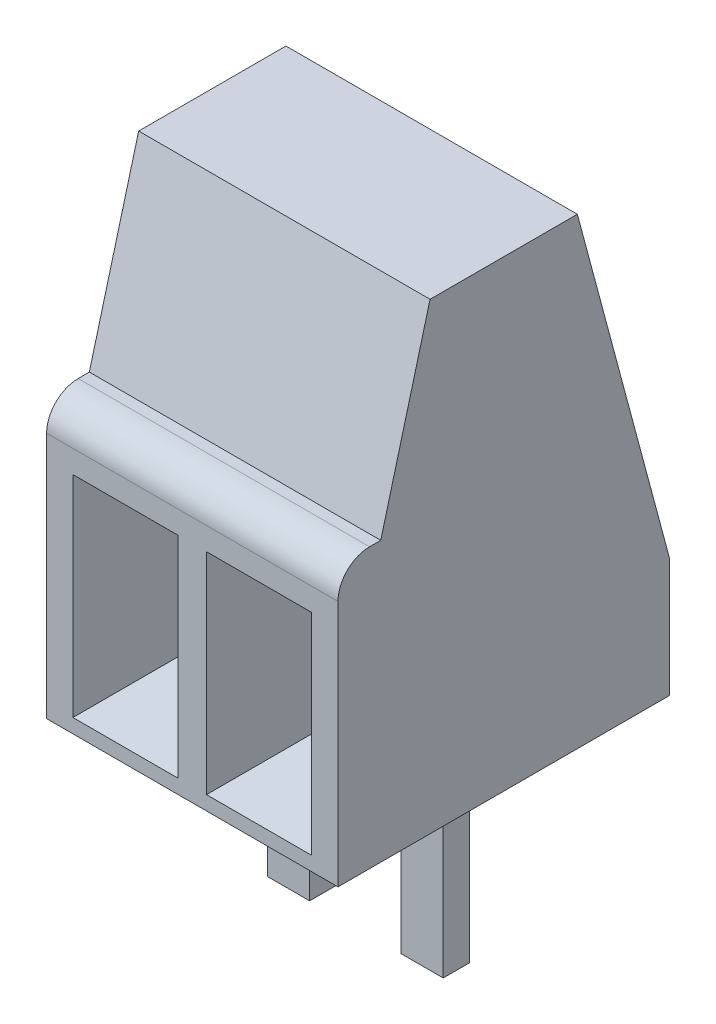
ISO-10303-21;
HEADER;
FILE_DESCRIPTION(('STEP AP214'),'2;1');
FILE_NAME('part.step','',(''),(''),'','','');
FILE_SCHEMA(('AUTOMOTIVE_DESIGN { 1 0 10303 214 1 1 1 1 }'));
ENDSEC;
DATA;
#1=APPLICATION_CONTEXT('core data for automotive mechanical design processes');
#2=APPLICATION_PROTOCOL_DEFINITION('international standard','automotive_design',2000,#1);
#3=PRODUCT_CONTEXT('',#1,'mechanical');
#4=PRODUCT('Part','Part','',(#3));
#5=PRODUCT_RELATED_PRODUCT_CATEGORY('part','',(#4));
#6=PRODUCT_DEFINITION_FORMATION('','',#4);
#7=PRODUCT_DEFINITION_CONTEXT('part definition',#1,'design');
#8=PRODUCT_DEFINITION('design','',#6,#7);
#9=PRODUCT_DEFINITION_SHAPE('','',#8);
#10=(LENGTH_UNIT() NAMED_UNIT(*) SI_UNIT(.MILLI.,.METRE.));
#11=(NAMED_UNIT(*) PLANE_ANGLE_UNIT() SI_UNIT($,.RADIAN.));
#12=(NAMED_UNIT(*) SI_UNIT($,.STERADIAN.) SOLID_ANGLE_UNIT());
#13=UNCERTAINTY_MEASURE_WITH_UNIT(LENGTH_MEASURE(1.E-05),#10,'distance_accuracy_value','');
#14=(GEOMETRIC_REPRESENTATION_CONTEXT(3) GLOBAL_UNCERTAINTY_ASSIGNED_CONTEXT((#13)) GLOBAL_UNIT_ASSIGNED_CONTEXT((#10,
#11,#12)) REPRESENTATION_CONTEXT('',''));
#15=CARTESIAN_POINT('',(0.,0.,0.));
#16=DIRECTION('',(0.,0.,1.));
#17=DIRECTION('',(1.,0.,0.));
#18=AXIS2_PLACEMENT_3D('',#15,#16,#17);
#19=CARTESIAN_POINT('',(2.77,8.8,3.15));
#20=DIRECTION('',(-1.,0.,0.));
#21=DIRECTION('',(0.,0.,1.));
#22=AXIS2_PLACEMENT_3D('',#19,#20,#21);
#23=PLANE('',#22);
#24=DIRECTION('',(0.,0.,-1.));
#25=VECTOR('',#24,1.);
#26=CARTESIAN_POINT('',(2.77,8.8,3.15));
#27=LINE('',#26,#25);
#28=CARTESIAN_POINT('',(2.77,8.8,1.4));
#29=VERTEX_POINT('',#28);
#30=CARTESIAN_POINT('',(2.77,8.8,-1.4));
#31=VERTEX_POINT('',#30);
#32=EDGE_CURVE('E361',#29,#31,#27,.T.);
#33=ORIENTED_EDGE('',*,*,#32,.F.);
#34=DIRECTION('',(0.,0.965925826289069,-0.258819045102518));
#35=VECTOR('',#34,1.);
#36=CARTESIAN_POINT('',(2.77,0.939488223348452,3.50621778264909));
#37=LINE('',#36,#35);
#38=CARTESIAN_POINT('',(2.77,5.3,2.33782217350892));
#39=VERTEX_POINT('',#38);
#40=EDGE_CURVE('E276',#39,#29,#37,.T.);
#41=ORIENTED_EDGE('',*,*,#40,.F.);
#42=DIRECTION('',(0.,0.,-1.));
#43=VECTOR('',#42,1.);
#44=CARTESIAN_POINT('',(2.77,5.3,0.));
#45=LINE('',#44,#43);
#46=CARTESIAN_POINT('',(2.77,5.3,2.55));
#47=VERTEX_POINT('',#46);
#48=EDGE_CURVE('E273',#47,#39,#45,.T.);
#49=ORIENTED_EDGE('',*,*,#48,.F.);
#50=CARTESIAN_POINT('',(2.77,4.7,2.55));
#51=DIRECTION('',(1.,0.,0.));
#52=DIRECTION('',(0.,0.,-1.));
#53=AXIS2_PLACEMENT_3D('',#50,#51,#52);
#54=CIRCLE('',#53,0.599999999999999);
#55=CARTESIAN_POINT('',(2.77,4.7,3.15));
#56=VERTEX_POINT('',#55);
#57=EDGE_CURVE('E270',#56,#47,#54,.F.);
#58=ORIENTED_EDGE('',*,*,#57,.F.);
#59=DIRECTION('',(0.,-1.,0.));
#60=VECTOR('',#59,1.);
#61=CARTESIAN_POINT('',(2.77,8.8,3.15));
#62=LINE('',#61,#60);
#63=CARTESIAN_POINT('',(2.77,0.,3.15));
#64=VERTEX_POINT('',#63);
#65=EDGE_CURVE('E368',#56,#64,#62,.T.);
#66=ORIENTED_EDGE('',*,*,#65,.T.);
#67=DIRECTION('',(0.,0.,-1.));
#68=VECTOR('',#67,1.);
#69=CARTESIAN_POINT('',(2.77,0.,3.15));
#70=LINE('',#69,#68);
#71=CARTESIAN_POINT('',(2.77,0.,-3.15));
#72=VERTEX_POINT('',#71);
#73=EDGE_CURVE('E352',#64,#72,#70,.T.);
#74=ORIENTED_EDGE('',*,*,#73,.T.);
#75=DIRECTION('',(0.,-1.,0.));
#76=VECTOR('',#75,1.);
#77=CARTESIAN_POINT('',(2.77,8.8,-3.15));
#78=LINE('',#77,#76);
#79=CARTESIAN_POINT('',(2.77,2.26891108675449,-3.15));
#80=VERTEX_POINT('',#79);
#81=EDGE_CURVE('E11',#80,#72,#78,.T.);
#82=ORIENTED_EDGE('',*,*,#81,.F.);
#83=DIRECTION('',(0.,-0.965925826289068,-0.258819045102522));
#84=VECTOR('',#83,1.);
#85=CARTESIAN_POINT('',(2.77,0.939488223348475,-3.50621778264911));
#86=LINE('',#85,#84);
#87=EDGE_CURVE('E222',#31,#80,#86,.T.);
#88=ORIENTED_EDGE('',*,*,#87,.F.);
#89=EDGE_LOOP('',(#33,#41,#49,#58,#66,#74,#82,#88));
#90=FACE_BOUND('',#89,.T.);
#91=ADVANCED_FACE('F33',(#90),#23,.F.);
#92=CARTESIAN_POINT('',(-2.77,8.8,-3.15));
#93=DIRECTION('',(0.,0.,1.));
#94=DIRECTION('',(1.,0.,0.));
#95=AXIS2_PLACEMENT_3D('',#92,#93,#94);
#96=PLANE('',#95);
#97=DIRECTION('',(0.,-1.,0.));
#98=VECTOR('',#97,1.);
#99=CARTESIAN_POINT('',(-2.77,8.8,-3.15));
#100=LINE('',#99,#98);
#101=CARTESIAN_POINT('',(-2.77,2.26891108675449,-3.15));
#102=VERTEX_POINT('',#101);
#103=CARTESIAN_POINT('',(-2.77,0.,-3.15));
#104=VERTEX_POINT('',#103);
#105=EDGE_CURVE('E40',#102,#104,#100,.T.);
#106=ORIENTED_EDGE('',*,*,#105,.F.);
#107=DIRECTION('',(1.,0.,0.));
#108=VECTOR('',#107,1.);
#109=CARTESIAN_POINT('',(-2.771,2.26891108675449,-3.15));
#110=LINE('',#109,#108);
#111=EDGE_CURVE('E292',#102,#80,#110,.T.);
#112=ORIENTED_EDGE('',*,*,#111,.T.);
#113=ORIENTED_EDGE('',*,*,#81,.T.);
#114=DIRECTION('',(-1.,0.,0.));
#115=VECTOR('',#114,1.);
#116=CARTESIAN_POINT('',(-2.77,0.,-3.15));
#117=LINE('',#116,#115);
#118=EDGE_CURVE('E371',#72,#104,#117,.T.);
#119=ORIENTED_EDGE('',*,*,#118,.T.);
#120=EDGE_LOOP('',(#106,#112,#113,#119));
#121=FACE_BOUND('',#120,.T.);
#122=ADVANCED_FACE('F392',(#121),#96,.F.);
#123=CARTESIAN_POINT('',(-2.77,8.8,3.15));
#124=DIRECTION('',(1.,0.,0.));
#125=DIRECTION('',(0.,0.,-1.));
#126=AXIS2_PLACEMENT_3D('',#123,#124,#125);
#127=PLANE('',#126);
#128=DIRECTION('',(0.,0.,1.));
#129=VECTOR('',#128,1.);
#130=CARTESIAN_POINT('',(-2.77,5.3,0.));
#131=LINE('',#130,#129);
#132=CARTESIAN_POINT('',(-2.77,5.3,2.33782217350892));
#133=VERTEX_POINT('',#132);
#134=CARTESIAN_POINT('',(-2.77,5.3,2.55));
#135=VERTEX_POINT('',#134);
#136=EDGE_CURVE('E263',#133,#135,#131,.T.);
#137=ORIENTED_EDGE('',*,*,#136,.F.);
#138=DIRECTION('',(0.,-0.965925826289069,0.258819045102518));
#139=VECTOR('',#138,1.);
#140=CARTESIAN_POINT('',(-2.77,0.939488223348452,3.50621778264909));
#141=LINE('',#140,#139);
#142=CARTESIAN_POINT('',(-2.77,8.8,1.4));
#143=VERTEX_POINT('',#142);
#144=EDGE_CURVE('E266',#143,#133,#141,.T.);
#145=ORIENTED_EDGE('',*,*,#144,.F.);
#146=DIRECTION('',(0.,0.,1.));
#147=VECTOR('',#146,1.);
#148=CARTESIAN_POINT('',(-2.77,8.8,3.15));
#149=LINE('',#148,#147);
#150=CARTESIAN_POINT('',(-2.77,8.8,-1.4));
#151=VERTEX_POINT('',#150);
#152=EDGE_CURVE('E364',#151,#143,#149,.T.);
#153=ORIENTED_EDGE('',*,*,#152,.F.);
#154=DIRECTION('',(0.,0.965925826289068,0.258819045102522));
#155=VECTOR('',#154,1.);
#156=CARTESIAN_POINT('',(-2.77,0.939488223348475,-3.50621778264911));
#157=LINE('',#156,#155);
#158=EDGE_CURVE('E267',#102,#151,#157,.T.);
#159=ORIENTED_EDGE('',*,*,#158,.F.);
#160=ORIENTED_EDGE('',*,*,#105,.T.);
#161=DIRECTION('',(0.,0.,1.));
#162=VECTOR('',#161,1.);
#163=CARTESIAN_POINT('',(-2.77,0.,3.15));
#164=LINE('',#163,#162);
#165=CARTESIAN_POINT('',(-2.77,0.,3.15));
#166=VERTEX_POINT('',#165);
#167=EDGE_CURVE('E374',#104,#166,#164,.T.);
#168=ORIENTED_EDGE('',*,*,#167,.T.);
#169=DIRECTION('',(0.,-1.,0.));
#170=VECTOR('',#169,1.);
#171=CARTESIAN_POINT('',(-2.77,8.8,3.15));
#172=LINE('',#171,#170);
#173=CARTESIAN_POINT('',(-2.77,4.7,3.15));
#174=VERTEX_POINT('',#173);
#175=EDGE_CURVE('E380',#174,#166,#172,.T.);
#176=ORIENTED_EDGE('',*,*,#175,.F.);
#177=CARTESIAN_POINT('',(-2.77,4.7,2.55));
#178=DIRECTION('',(1.,0.,0.));
#179=DIRECTION('',(0.,0.,-1.));
#180=AXIS2_PLACEMENT_3D('',#177,#178,#179);
#181=CIRCLE('',#180,0.599999999999999);
#182=EDGE_CURVE('E282',#135,#174,#181,.T.);
#183=ORIENTED_EDGE('',*,*,#182,.F.);
#184=EDGE_LOOP('',(#137,#145,#153,#159,#160,#168,#176,#183));
#185=FACE_BOUND('',#184,.T.);
#186=ADVANCED_FACE('F385',(#185),#127,.F.);
#187=CARTESIAN_POINT('',(-2.77,8.8,3.15));
#188=DIRECTION('',(0.,0.,-1.));
#189=DIRECTION('',(-1.,0.,0.));
#190=AXIS2_PLACEMENT_3D('',#187,#188,#189);
#191=PLANE('',#190);
#192=DIRECTION('',(-1.,0.,0.));
#193=VECTOR('',#192,1.);
#194=CARTESIAN_POINT('',(-2.27,4.26891108675449,3.15));
#195=LINE('',#194,#193);
#196=CARTESIAN_POINT('',(-0.27,4.26891108675449,3.15));
#197=VERTEX_POINT('',#196);
#198=CARTESIAN_POINT('',(-2.27,4.26891108675449,3.15));
#199=VERTEX_POINT('',#198);
#200=EDGE_CURVE('E207',#197,#199,#195,.T.);
#201=ORIENTED_EDGE('',*,*,#200,.F.);
#202=DIRECTION('',(0.,1.,0.));
#203=VECTOR('',#202,1.);
#204=CARTESIAN_POINT('',(-0.27,0.268911086754488,3.15));
#205=LINE('',#204,#203);
#206=CARTESIAN_POINT('',(-0.27,0.268911086754488,3.15));
#207=VERTEX_POINT('',#206);
#208=EDGE_CURVE('E47',#207,#197,#205,.T.);
#209=ORIENTED_EDGE('',*,*,#208,.F.);
#210=DIRECTION('',(1.,0.,0.));
#211=VECTOR('',#210,1.);
#212=CARTESIAN_POINT('',(-2.27,0.268911086754488,3.15));
#213=LINE('',#212,#211);
#214=CARTESIAN_POINT('',(-2.27,0.268911086754488,3.15));
#215=VERTEX_POINT('',#214);
#216=EDGE_CURVE('E214',#215,#207,#213,.T.);
#217=ORIENTED_EDGE('',*,*,#216,.F.);
#218=DIRECTION('',(0.,-1.,0.));
#219=VECTOR('',#218,1.);
#220=CARTESIAN_POINT('',(-2.27,0.268911086754488,3.15));
#221=LINE('',#220,#219);
#222=EDGE_CURVE('E196',#199,#215,#221,.T.);
#223=ORIENTED_EDGE('',*,*,#222,.F.);
#224=EDGE_LOOP('',(#201,#209,#217,#223));
#225=FACE_BOUND('',#224,.T.);
#226=DIRECTION('',(1.,0.,0.));
#227=VECTOR('',#226,1.);
#228=CARTESIAN_POINT('',(2.27,0.268911086754488,3.15));
#229=LINE('',#228,#227);
#230=CARTESIAN_POINT('',(0.27,0.268911086754487,3.15));
#231=VERTEX_POINT('',#230);
#232=CARTESIAN_POINT('',(2.27,0.268911086754488,3.15));
#233=VERTEX_POINT('',#232);
#234=EDGE_CURVE('E234',#231,#233,#229,.T.);
#235=ORIENTED_EDGE('',*,*,#234,.F.);
#236=DIRECTION('',(0.,-1.,0.));
#237=VECTOR('',#236,1.);
#238=CARTESIAN_POINT('',(0.269999999999999,4.26891108675449,3.15));
#239=LINE('',#238,#237);
#240=CARTESIAN_POINT('',(0.269999999999999,4.26891108675449,3.15));
#241=VERTEX_POINT('',#240);
#242=EDGE_CURVE('E55',#241,#231,#239,.T.);
#243=ORIENTED_EDGE('',*,*,#242,.F.);
#244=DIRECTION('',(-1.,0.,0.));
#245=VECTOR('',#244,1.);
#246=CARTESIAN_POINT('',(2.27,4.26891108675449,3.15));
#247=LINE('',#246,#245);
#248=CARTESIAN_POINT('',(2.27,4.26891108675449,3.15));
#249=VERTEX_POINT('',#248);
#250=EDGE_CURVE('E240',#249,#241,#247,.T.);
#251=ORIENTED_EDGE('',*,*,#250,.F.);
#252=DIRECTION('',(0.,1.,0.));
#253=VECTOR('',#252,1.);
#254=CARTESIAN_POINT('',(2.27,4.26891108675449,3.15));
#255=LINE('',#254,#253);
#256=EDGE_CURVE('E237',#233,#249,#255,.T.);
#257=ORIENTED_EDGE('',*,*,#256,.F.);
#258=EDGE_LOOP('',(#235,#243,#251,#257));
#259=FACE_BOUND('',#258,.T.);
#260=ORIENTED_EDGE('',*,*,#65,.F.);
#261=DIRECTION('',(1.,0.,0.));
#262=VECTOR('',#261,1.);
#263=CARTESIAN_POINT('',(-2.771,4.7,3.15));
#264=LINE('',#263,#262);
#265=EDGE_CURVE('E278',#174,#56,#264,.T.);
#266=ORIENTED_EDGE('',*,*,#265,.F.);
#267=ORIENTED_EDGE('',*,*,#175,.T.);
#268=DIRECTION('',(1.,0.,0.));
#269=VECTOR('',#268,1.);
#270=CARTESIAN_POINT('',(-2.77,0.,3.15));
#271=LINE('',#270,#269);
#272=EDGE_CURVE('E365',#166,#64,#271,.T.);
#273=ORIENTED_EDGE('',*,*,#272,.T.);
#274=EDGE_LOOP('',(#260,#266,#267,#273));
#275=FACE_BOUND('',#274,.T.);
#276=ADVANCED_FACE('F211',(#225,#259,#275),#191,.F.);
#277=CARTESIAN_POINT('',(0.,8.8,0.));
#278=DIRECTION('',(0.,-1.,0.));
#279=DIRECTION('',(0.,0.,-1.));
#280=AXIS2_PLACEMENT_3D('',#277,#278,#279);
#281=PLANE('',#280);
#282=ORIENTED_EDGE('',*,*,#152,.T.);
#283=DIRECTION('',(1.,0.,0.));
#284=VECTOR('',#283,1.);
#285=CARTESIAN_POINT('',(-2.771,8.8,1.4));
#286=LINE('',#285,#284);
#287=EDGE_CURVE('E279',#143,#29,#286,.T.);
#288=ORIENTED_EDGE('',*,*,#287,.T.);
#289=ORIENTED_EDGE('',*,*,#32,.T.);
#290=DIRECTION('',(1.,0.,0.));
#291=VECTOR('',#290,1.);
#292=CARTESIAN_POINT('',(-2.771,8.8,-1.4));
#293=LINE('',#292,#291);
#294=EDGE_CURVE('E291',#151,#31,#293,.T.);
#295=ORIENTED_EDGE('',*,*,#294,.F.);
#296=EDGE_LOOP('',(#282,#288,#289,#295));
#297=FACE_BOUND('',#296,.T.);
#298=ADVANCED_FACE('F413',(#297),#281,.F.);
#299=CARTESIAN_POINT('',(0.,0.,0.));
#300=DIRECTION('',(0.,-1.,0.));
#301=DIRECTION('',(0.,0.,-1.));
#302=AXIS2_PLACEMENT_3D('',#299,#300,#301);
#303=PLANE('',#302);
#304=DIRECTION('',(0.,0.,1.));
#305=VECTOR('',#304,1.);
#306=CARTESIAN_POINT('',(-1.67,0.,0.050000000000001));
#307=LINE('',#306,#305);
#308=CARTESIAN_POINT('',(-1.67,0.,-0.449999999999999));
#309=VERTEX_POINT('',#308);
#310=CARTESIAN_POINT('',(-1.67,0.,0.050000000000001));
#311=VERTEX_POINT('',#310);
#312=EDGE_CURVE('E289',#309,#311,#307,.T.);
#313=ORIENTED_EDGE('',*,*,#312,.T.);
#314=DIRECTION('',(1.,0.,0.));
#315=VECTOR('',#314,1.);
#316=CARTESIAN_POINT('',(-0.87,0.,0.0500000000000008));
#317=LINE('',#316,#315);
#318=CARTESIAN_POINT('',(-0.87,0.,0.0500000000000008));
#319=VERTEX_POINT('',#318);
#320=EDGE_CURVE('E312',#311,#319,#317,.T.);
#321=ORIENTED_EDGE('',*,*,#320,.T.);
#322=DIRECTION('',(0.,0.,-1.));
#323=VECTOR('',#322,1.);
#324=CARTESIAN_POINT('',(-0.87,0.,0.0500000000000008));
#325=LINE('',#324,#323);
#326=CARTESIAN_POINT('',(-0.87,0.,-0.449999999999999));
#327=VERTEX_POINT('',#326);
#328=EDGE_CURVE('E314',#319,#327,#325,.T.);
#329=ORIENTED_EDGE('',*,*,#328,.T.);
#330=DIRECTION('',(-1.,0.,0.));
#331=VECTOR('',#330,1.);
#332=CARTESIAN_POINT('',(-0.87,0.,-0.449999999999999));
#333=LINE('',#332,#331);
#334=EDGE_CURVE('E301',#327,#309,#333,.T.);
#335=ORIENTED_EDGE('',*,*,#334,.T.);
#336=EDGE_LOOP('',(#313,#321,#329,#335));
#337=FACE_BOUND('',#336,.T.);
#338=DIRECTION('',(0.,0.,-1.));
#339=VECTOR('',#338,1.);
#340=CARTESIAN_POINT('',(1.67,0.,0.0500000000000007));
#341=LINE('',#340,#339);
#342=CARTESIAN_POINT('',(1.67,0.,0.0500000000000007));
#343=VERTEX_POINT('',#342);
#344=CARTESIAN_POINT('',(1.67,0.,-0.449999999999999));
#345=VERTEX_POINT('',#344);
#346=EDGE_CURVE('E320',#343,#345,#341,.T.);
#347=ORIENTED_EDGE('',*,*,#346,.T.);
#348=DIRECTION('',(-1.,0.,0.));
#349=VECTOR('',#348,1.);
#350=CARTESIAN_POINT('',(0.87,0.,-0.449999999999999));
#351=LINE('',#350,#349);
#352=CARTESIAN_POINT('',(0.87,0.,-0.449999999999999));
#353=VERTEX_POINT('',#352);
#354=EDGE_CURVE('E344',#345,#353,#351,.T.);
#355=ORIENTED_EDGE('',*,*,#354,.T.);
#356=DIRECTION('',(0.,0.,1.));
#357=VECTOR('',#356,1.);
#358=CARTESIAN_POINT('',(0.87,0.,0.0500000000000007));
#359=LINE('',#358,#357);
#360=CARTESIAN_POINT('',(0.87,0.,0.0500000000000007));
#361=VERTEX_POINT('',#360);
#362=EDGE_CURVE('E346',#353,#361,#359,.T.);
#363=ORIENTED_EDGE('',*,*,#362,.T.);
#364=DIRECTION('',(1.,0.,0.));
#365=VECTOR('',#364,1.);
#366=CARTESIAN_POINT('',(0.87,0.,0.0500000000000007));
#367=LINE('',#366,#365);
#368=EDGE_CURVE('E333',#361,#343,#367,.T.);
#369=ORIENTED_EDGE('',*,*,#368,.T.);
#370=EDGE_LOOP('',(#347,#355,#363,#369));
#371=FACE_BOUND('',#370,.T.);
#372=ORIENTED_EDGE('',*,*,#73,.F.);
#373=ORIENTED_EDGE('',*,*,#272,.F.);
#374=ORIENTED_EDGE('',*,*,#167,.F.);
#375=ORIENTED_EDGE('',*,*,#118,.F.);
#376=EDGE_LOOP('',(#372,#373,#374,#375));
#377=FACE_BOUND('',#376,.T.);
#378=ADVANCED_FACE('F396',(#337,#371,#377),#303,.T.);
#379=CARTESIAN_POINT('',(1.67,-3.6,0.0500000000000007));
#380=DIRECTION('',(1.,0.,0.));
#381=DIRECTION('',(0.,0.,-1.));
#382=AXIS2_PLACEMENT_3D('',#379,#380,#381);
#383=PLANE('',#382);
#384=ORIENTED_EDGE('',*,*,#346,.F.);
#385=DIRECTION('',(0.,1.,0.));
#386=VECTOR('',#385,1.);
#387=CARTESIAN_POINT('',(1.67,-3.6,0.0500000000000007));
#388=LINE('',#387,#386);
#389=CARTESIAN_POINT('',(1.67,-3.6,0.0500000000000007));
#390=VERTEX_POINT('',#389);
#391=EDGE_CURVE('E349',#390,#343,#388,.T.);
#392=ORIENTED_EDGE('',*,*,#391,.F.);
#393=DIRECTION('',(0.,0.,-1.));
#394=VECTOR('',#393,1.);
#395=CARTESIAN_POINT('',(1.67,-3.6,0.0500000000000007));
#396=LINE('',#395,#394);
#397=CARTESIAN_POINT('',(1.67,-3.6,-0.449999999999999));
#398=VERTEX_POINT('',#397);
#399=EDGE_CURVE('E329',#390,#398,#396,.T.);
#400=ORIENTED_EDGE('',*,*,#399,.T.);
#401=DIRECTION('',(0.,1.,0.));
#402=VECTOR('',#401,1.);
#403=CARTESIAN_POINT('',(1.67,-3.6,-0.449999999999999));
#404=LINE('',#403,#402);
#405=EDGE_CURVE('E342',#398,#345,#404,.T.);
#406=ORIENTED_EDGE('',*,*,#405,.T.);
#407=EDGE_LOOP('',(#384,#392,#400,#406));
#408=FACE_BOUND('',#407,.T.);
#409=ADVANCED_FACE('F432',(#408),#383,.T.);
#410=CARTESIAN_POINT('',(0.87,-3.6,0.0500000000000007));
#411=DIRECTION('',(0.,0.,1.));
#412=DIRECTION('',(1.,0.,0.));
#413=AXIS2_PLACEMENT_3D('',#410,#411,#412);
#414=PLANE('',#413);
#415=ORIENTED_EDGE('',*,*,#368,.F.);
#416=DIRECTION('',(0.,1.,0.));
#417=VECTOR('',#416,1.);
#418=CARTESIAN_POINT('',(0.87,-3.6,0.0500000000000007));
#419=LINE('',#418,#417);
#420=CARTESIAN_POINT('',(0.87,-3.6,0.0500000000000007));
#421=VERTEX_POINT('',#420);
#422=EDGE_CURVE('E353',#421,#361,#419,.T.);
#423=ORIENTED_EDGE('',*,*,#422,.F.);
#424=DIRECTION('',(1.,0.,0.));
#425=VECTOR('',#424,1.);
#426=CARTESIAN_POINT('',(0.87,-3.6,0.0500000000000007));
#427=LINE('',#426,#425);
#428=EDGE_CURVE('E339',#421,#390,#427,.T.);
#429=ORIENTED_EDGE('',*,*,#428,.T.);
#430=ORIENTED_EDGE('',*,*,#391,.T.);
#431=EDGE_LOOP('',(#415,#423,#429,#430));
#432=FACE_BOUND('',#431,.T.);
#433=ADVANCED_FACE('F438',(#432),#414,.T.);
#434=CARTESIAN_POINT('',(0.87,-3.6,0.0500000000000007));
#435=DIRECTION('',(-1.,0.,0.));
#436=DIRECTION('',(0.,0.,1.));
#437=AXIS2_PLACEMENT_3D('',#434,#435,#436);
#438=PLANE('',#437);
#439=ORIENTED_EDGE('',*,*,#362,.F.);
#440=DIRECTION('',(0.,1.,0.));
#441=VECTOR('',#440,1.);
#442=CARTESIAN_POINT('',(0.87,-3.6,-0.449999999999999));
#443=LINE('',#442,#441);
#444=CARTESIAN_POINT('',(0.87,-3.6,-0.449999999999999));
#445=VERTEX_POINT('',#444);
#446=EDGE_CURVE('E356',#445,#353,#443,.T.);
#447=ORIENTED_EDGE('',*,*,#446,.F.);
#448=DIRECTION('',(0.,0.,1.));
#449=VECTOR('',#448,1.);
#450=CARTESIAN_POINT('',(0.87,-3.6,0.0500000000000007));
#451=LINE('',#450,#449);
#452=EDGE_CURVE('E336',#445,#421,#451,.T.);
#453=ORIENTED_EDGE('',*,*,#452,.T.);
#454=ORIENTED_EDGE('',*,*,#422,.T.);
#455=EDGE_LOOP('',(#439,#447,#453,#454));
#456=FACE_BOUND('',#455,.T.);
#457=ADVANCED_FACE('F444',(#456),#438,.T.);
#458=CARTESIAN_POINT('',(0.87,-3.6,-0.449999999999999));
#459=DIRECTION('',(0.,0.,-1.));
#460=DIRECTION('',(-1.,0.,0.));
#461=AXIS2_PLACEMENT_3D('',#458,#459,#460);
#462=PLANE('',#461);
#463=ORIENTED_EDGE('',*,*,#354,.F.);
#464=ORIENTED_EDGE('',*,*,#405,.F.);
#465=DIRECTION('',(-1.,0.,0.));
#466=VECTOR('',#465,1.);
#467=CARTESIAN_POINT('',(0.87,-3.6,-0.449999999999999));
#468=LINE('',#467,#466);
#469=EDGE_CURVE('E332',#398,#445,#468,.T.);
#470=ORIENTED_EDGE('',*,*,#469,.T.);
#471=ORIENTED_EDGE('',*,*,#446,.T.);
#472=EDGE_LOOP('',(#463,#464,#470,#471));
#473=FACE_BOUND('',#472,.T.);
#474=ADVANCED_FACE('F440',(#473),#462,.T.);
#475=CARTESIAN_POINT('',(0.,-3.6,0.));
#476=DIRECTION('',(0.,-1.,0.));
#477=DIRECTION('',(0.,0.,-1.));
#478=AXIS2_PLACEMENT_3D('',#475,#476,#477);
#479=PLANE('',#478);
#480=ORIENTED_EDGE('',*,*,#399,.F.);
#481=ORIENTED_EDGE('',*,*,#428,.F.);
#482=ORIENTED_EDGE('',*,*,#452,.F.);
#483=ORIENTED_EDGE('',*,*,#469,.F.);
#484=EDGE_LOOP('',(#480,#481,#482,#483));
#485=FACE_BOUND('',#484,.T.);
#486=ADVANCED_FACE('F443',(#485),#479,.T.);
#487=CARTESIAN_POINT('',(-1.67,-3.6,0.050000000000001));
#488=DIRECTION('',(-1.,0.,0.));
#489=DIRECTION('',(0.,0.,1.));
#490=AXIS2_PLACEMENT_3D('',#487,#488,#489);
#491=PLANE('',#490);
#492=ORIENTED_EDGE('',*,*,#312,.F.);
#493=DIRECTION('',(0.,1.,0.));
#494=VECTOR('',#493,1.);
#495=CARTESIAN_POINT('',(-1.67,-3.6,-0.449999999999999));
#496=LINE('',#495,#494);
#497=CARTESIAN_POINT('',(-1.67,-3.6,-0.449999999999999));
#498=VERTEX_POINT('',#497);
#499=EDGE_CURVE('E317',#498,#309,#496,.T.);
#500=ORIENTED_EDGE('',*,*,#499,.F.);
#501=DIRECTION('',(0.,0.,1.));
#502=VECTOR('',#501,1.);
#503=CARTESIAN_POINT('',(-1.67,-3.6,0.050000000000001));
#504=LINE('',#503,#502);
#505=CARTESIAN_POINT('',(-1.67,-3.6,0.050000000000001));
#506=VERTEX_POINT('',#505);
#507=EDGE_CURVE('E297',#498,#506,#504,.T.);
#508=ORIENTED_EDGE('',*,*,#507,.T.);
#509=DIRECTION('',(0.,1.,0.));
#510=VECTOR('',#509,1.);
#511=CARTESIAN_POINT('',(-1.67,-3.6,0.050000000000001));
#512=LINE('',#511,#510);
#513=EDGE_CURVE('E310',#506,#311,#512,.T.);
#514=ORIENTED_EDGE('',*,*,#513,.T.);
#515=EDGE_LOOP('',(#492,#500,#508,#514));
#516=FACE_BOUND('',#515,.T.);
#517=ADVANCED_FACE('F454',(#516),#491,.T.);
#518=CARTESIAN_POINT('',(-0.87,-3.6,-0.449999999999999));
#519=DIRECTION('',(0.,0.,-1.));
#520=DIRECTION('',(-1.,0.,0.));
#521=AXIS2_PLACEMENT_3D('',#518,#519,#520);
#522=PLANE('',#521);
#523=ORIENTED_EDGE('',*,*,#334,.F.);
#524=DIRECTION('',(0.,1.,0.));
#525=VECTOR('',#524,1.);
#526=CARTESIAN_POINT('',(-0.87,-3.6,-0.449999999999999));
#527=LINE('',#526,#525);
#528=CARTESIAN_POINT('',(-0.87,-3.6,-0.449999999999999));
#529=VERTEX_POINT('',#528);
#530=EDGE_CURVE('E321',#529,#327,#527,.T.);
#531=ORIENTED_EDGE('',*,*,#530,.F.);
#532=DIRECTION('',(-1.,0.,0.));
#533=VECTOR('',#532,1.);
#534=CARTESIAN_POINT('',(-0.87,-3.6,-0.449999999999999));
#535=LINE('',#534,#533);
#536=EDGE_CURVE('E307',#529,#498,#535,.T.);
#537=ORIENTED_EDGE('',*,*,#536,.T.);
#538=ORIENTED_EDGE('',*,*,#499,.T.);
#539=EDGE_LOOP('',(#523,#531,#537,#538));
#540=FACE_BOUND('',#539,.T.);
#541=ADVANCED_FACE('F458',(#540),#522,.T.);
#542=CARTESIAN_POINT('',(-0.87,-3.6,0.0500000000000008));
#543=DIRECTION('',(1.,0.,0.));
#544=DIRECTION('',(0.,0.,-1.));
#545=AXIS2_PLACEMENT_3D('',#542,#543,#544);
#546=PLANE('',#545);
#547=ORIENTED_EDGE('',*,*,#328,.F.);
#548=DIRECTION('',(0.,1.,0.));
#549=VECTOR('',#548,1.);
#550=CARTESIAN_POINT('',(-0.87,-3.6,0.0500000000000008));
#551=LINE('',#550,#549);
#552=CARTESIAN_POINT('',(-0.87,-3.6,0.0500000000000008));
#553=VERTEX_POINT('',#552);
#554=EDGE_CURVE('E324',#553,#319,#551,.T.);
#555=ORIENTED_EDGE('',*,*,#554,.F.);
#556=DIRECTION('',(0.,0.,-1.));
#557=VECTOR('',#556,1.);
#558=CARTESIAN_POINT('',(-0.87,-3.6,0.0500000000000008));
#559=LINE('',#558,#557);
#560=EDGE_CURVE('E304',#553,#529,#559,.T.);
#561=ORIENTED_EDGE('',*,*,#560,.T.);
#562=ORIENTED_EDGE('',*,*,#530,.T.);
#563=EDGE_LOOP('',(#547,#555,#561,#562));
#564=FACE_BOUND('',#563,.T.);
#565=ADVANCED_FACE('F464',(#564),#546,.T.);
#566=CARTESIAN_POINT('',(-0.87,-3.6,0.0500000000000008));
#567=DIRECTION('',(0.,0.,1.));
#568=DIRECTION('',(1.,0.,0.));
#569=AXIS2_PLACEMENT_3D('',#566,#567,#568);
#570=PLANE('',#569);
#571=ORIENTED_EDGE('',*,*,#320,.F.);
#572=ORIENTED_EDGE('',*,*,#513,.F.);
#573=DIRECTION('',(1.,0.,0.));
#574=VECTOR('',#573,1.);
#575=CARTESIAN_POINT('',(-0.87,-3.6,0.0500000000000008));
#576=LINE('',#575,#574);
#577=EDGE_CURVE('E300',#506,#553,#576,.T.);
#578=ORIENTED_EDGE('',*,*,#577,.T.);
#579=ORIENTED_EDGE('',*,*,#554,.T.);
#580=EDGE_LOOP('',(#571,#572,#578,#579));
#581=FACE_BOUND('',#580,.T.);
#582=ADVANCED_FACE('F460',(#581),#570,.T.);
#583=CARTESIAN_POINT('',(0.,-3.6,0.));
#584=DIRECTION('',(0.,1.,0.));
#585=DIRECTION('',(0.,0.,1.));
#586=AXIS2_PLACEMENT_3D('',#583,#584,#585);
#587=PLANE('',#586);
#588=ORIENTED_EDGE('',*,*,#507,.F.);
#589=ORIENTED_EDGE('',*,*,#536,.F.);
#590=ORIENTED_EDGE('',*,*,#560,.F.);
#591=ORIENTED_EDGE('',*,*,#577,.F.);
#592=EDGE_LOOP('',(#588,#589,#590,#591));
#593=FACE_BOUND('',#592,.T.);
#594=ADVANCED_FACE('F463',(#593),#587,.F.);
#595=CARTESIAN_POINT('',(-2.771,0.939488223348475,-3.50621778264911));
#596=DIRECTION('',(0.,-0.258819045102522,0.965925826289068));
#597=DIRECTION('',(0.,-0.965925826289068,-0.258819045102522));
#598=AXIS2_PLACEMENT_3D('',#595,#596,#597);
#599=PLANE('',#598);
#600=ORIENTED_EDGE('',*,*,#158,.T.);
#601=ORIENTED_EDGE('',*,*,#294,.T.);
#602=ORIENTED_EDGE('',*,*,#87,.T.);
#603=ORIENTED_EDGE('',*,*,#111,.F.);
#604=EDGE_LOOP('',(#600,#601,#602,#603));
#605=FACE_BOUND('',#604,.T.);
#606=ADVANCED_FACE('F417',(#605),#599,.F.);
#607=CARTESIAN_POINT('',(-2.771,0.939488223348452,3.50621778264909));
#608=DIRECTION('',(0.,-0.258819045102518,-0.965925826289069));
#609=DIRECTION('',(0.,0.965925826289069,-0.258819045102518));
#610=AXIS2_PLACEMENT_3D('',#607,#608,#609);
#611=PLANE('',#610);
#612=ORIENTED_EDGE('',*,*,#144,.T.);
#613=DIRECTION('',(1.,0.,0.));
#614=VECTOR('',#613,1.);
#615=CARTESIAN_POINT('',(-2.771,5.3,2.33782217350892));
#616=LINE('',#615,#614);
#617=EDGE_CURVE('E283',#133,#39,#616,.T.);
#618=ORIENTED_EDGE('',*,*,#617,.T.);
#619=ORIENTED_EDGE('',*,*,#40,.T.);
#620=ORIENTED_EDGE('',*,*,#287,.F.);
#621=EDGE_LOOP('',(#612,#618,#619,#620));
#622=FACE_BOUND('',#621,.T.);
#623=ADVANCED_FACE('F410',(#622),#611,.F.);
#624=CARTESIAN_POINT('',(-2.771,5.3,0.));
#625=DIRECTION('',(0.,-1.,0.));
#626=DIRECTION('',(0.,0.,-1.));
#627=AXIS2_PLACEMENT_3D('',#624,#625,#626);
#628=PLANE('',#627);
#629=ORIENTED_EDGE('',*,*,#136,.T.);
#630=DIRECTION('',(1.,0.,0.));
#631=VECTOR('',#630,1.);
#632=CARTESIAN_POINT('',(-2.771,5.3,2.55));
#633=LINE('',#632,#631);
#634=EDGE_CURVE('E285',#135,#47,#633,.T.);
#635=ORIENTED_EDGE('',*,*,#634,.T.);
#636=ORIENTED_EDGE('',*,*,#48,.T.);
#637=ORIENTED_EDGE('',*,*,#617,.F.);
#638=EDGE_LOOP('',(#629,#635,#636,#637));
#639=FACE_BOUND('',#638,.T.);
#640=ADVANCED_FACE('F407',(#639),#628,.F.);
#641=CARTESIAN_POINT('',(-2.771,4.7,2.55));
#642=DIRECTION('',(1.,0.,0.));
#643=DIRECTION('',(0.,0.,-1.));
#644=AXIS2_PLACEMENT_3D('',#641,#642,#643);
#645=CYLINDRICAL_SURFACE('',#644,0.599999999999999);
#646=ORIENTED_EDGE('',*,*,#182,.T.);
#647=ORIENTED_EDGE('',*,*,#265,.T.);
#648=ORIENTED_EDGE('',*,*,#57,.T.);
#649=ORIENTED_EDGE('',*,*,#634,.F.);
#650=EDGE_LOOP('',(#646,#647,#648,#649));
#651=FACE_BOUND('',#650,.T.);
#652=ADVANCED_FACE('F403',(#651),#645,.T.);
#653=CARTESIAN_POINT('',(0.269999999999999,4.26891108675449,3.15));
#654=DIRECTION('',(-0.984807753012208,0.,-0.173648177666931));
#655=DIRECTION('',(-0.173648177666931,0.,0.984807753012208));
#656=AXIS2_PLACEMENT_3D('',#653,#654,#655);
#657=PLANE('',#656);
#658=ORIENTED_EDGE('',*,*,#242,.T.);
#659=DIRECTION('',(-0.171087869746036,-0.171087869746036,0.970287525247814));
#660=VECTOR('',#659,1.);
#661=CARTESIAN_POINT('',(0.387084236696946,0.385995323451434,2.48598229705679));
#662=LINE('',#661,#660);
#663=CARTESIAN_POINT('',(0.825429989231666,0.824341075986154,0.));
#664=VERTEX_POINT('',#663);
#665=EDGE_CURVE('E247',#664,#231,#662,.T.);
#666=ORIENTED_EDGE('',*,*,#665,.F.);
#667=DIRECTION('',(0.,-1.,0.));
#668=VECTOR('',#667,1.);
#669=CARTESIAN_POINT('',(0.825429989231665,4.26891108675449,0.));
#670=LINE('',#669,#668);
#671=CARTESIAN_POINT('',(0.825429989231665,3.71348109752282,0.));
#672=VERTEX_POINT('',#671);
#673=EDGE_CURVE('E243',#672,#664,#670,.T.);
#674=ORIENTED_EDGE('',*,*,#673,.F.);
#675=DIRECTION('',(-0.171087869746036,0.171087869746036,0.970287525247814));
#676=VECTOR('',#675,1.);
#677=CARTESIAN_POINT('',(0.328542118348473,4.21036896840601,2.8179911485284));
#678=LINE('',#677,#676);
#679=EDGE_CURVE('E244',#672,#241,#678,.T.);
#680=ORIENTED_EDGE('',*,*,#679,.T.);
#681=EDGE_LOOP('',(#658,#666,#674,#680));
#682=FACE_BOUND('',#681,.T.);
#683=ADVANCED_FACE('F479',(#682),#657,.F.);
#684=CARTESIAN_POINT('',(2.27,4.26891108675449,3.15));
#685=DIRECTION('',(0.,0.984807753012208,-0.173648177666931));
#686=DIRECTION('',(0.,0.173648177666931,0.984807753012208));
#687=AXIS2_PLACEMENT_3D('',#684,#685,#686);
#688=PLANE('',#687);
#689=ORIENTED_EDGE('',*,*,#250,.T.);
#690=ORIENTED_EDGE('',*,*,#679,.F.);
#691=DIRECTION('',(-1.,0.,0.));
#692=VECTOR('',#691,1.);
#693=CARTESIAN_POINT('',(2.27,3.71348109752282,0.));
#694=LINE('',#693,#692);
#695=CARTESIAN_POINT('',(1.71457001076833,3.71348109752282,0.));
#696=VERTEX_POINT('',#695);
#697=EDGE_CURVE('E250',#696,#672,#694,.T.);
#698=ORIENTED_EDGE('',*,*,#697,.F.);
#699=DIRECTION('',(0.171087869746036,0.171087869746036,0.970287525247814));
#700=VECTOR('',#699,1.);
#701=CARTESIAN_POINT('',(2.27,4.26891108675449,3.15));
#702=LINE('',#701,#700);
#703=EDGE_CURVE('E246',#696,#249,#702,.T.);
#704=ORIENTED_EDGE('',*,*,#703,.T.);
#705=EDGE_LOOP('',(#689,#690,#698,#704));
#706=FACE_BOUND('',#705,.T.);
#707=ADVANCED_FACE('F484',(#706),#688,.F.);
#708=CARTESIAN_POINT('',(2.27,4.26891108675449,3.15));
#709=DIRECTION('',(0.984807753012208,0.,-0.173648177666931));
#710=DIRECTION('',(-0.173648177666931,0.,-0.984807753012208));
#711=AXIS2_PLACEMENT_3D('',#708,#709,#710);
#712=PLANE('',#711);
#713=ORIENTED_EDGE('',*,*,#256,.T.);
#714=ORIENTED_EDGE('',*,*,#703,.F.);
#715=DIRECTION('',(0.,1.,0.));
#716=VECTOR('',#715,1.);
#717=CARTESIAN_POINT('',(1.71457001076833,4.26891108675449,0.));
#718=LINE('',#717,#716);
#719=CARTESIAN_POINT('',(1.71457001076833,0.824341075986154,0.));
#720=VERTEX_POINT('',#719);
#721=EDGE_CURVE('E258',#720,#696,#718,.T.);
#722=ORIENTED_EDGE('',*,*,#721,.F.);
#723=DIRECTION('',(0.171087869746036,-0.171087869746036,0.970287525247814));
#724=VECTOR('',#723,1.);
#725=CARTESIAN_POINT('',(2.27,0.268911086754488,3.15));
#726=LINE('',#725,#724);
#727=EDGE_CURVE('E249',#720,#233,#726,.T.);
#728=ORIENTED_EDGE('',*,*,#727,.T.);
#729=EDGE_LOOP('',(#713,#714,#722,#728));
#730=FACE_BOUND('',#729,.T.);
#731=ADVANCED_FACE('F487',(#730),#712,.F.);
#732=CARTESIAN_POINT('',(2.27,0.268911086754488,3.15));
#733=DIRECTION('',(0.,-0.984807753012208,-0.173648177666931));
#734=DIRECTION('',(0.,0.173648177666931,-0.984807753012208));
#735=AXIS2_PLACEMENT_3D('',#732,#733,#734);
#736=PLANE('',#735);
#737=ORIENTED_EDGE('',*,*,#234,.T.);
#738=ORIENTED_EDGE('',*,*,#727,.F.);
#739=DIRECTION('',(1.,0.,0.));
#740=VECTOR('',#739,1.);
#741=CARTESIAN_POINT('',(2.27,0.824341075986154,0.));
#742=LINE('',#741,#740);
#743=EDGE_CURVE('E255',#664,#720,#742,.T.);
#744=ORIENTED_EDGE('',*,*,#743,.F.);
#745=ORIENTED_EDGE('',*,*,#665,.T.);
#746=EDGE_LOOP('',(#737,#738,#744,#745));
#747=FACE_BOUND('',#746,.T.);
#748=ADVANCED_FACE('F491',(#747),#736,.F.);
#749=CARTESIAN_POINT('',(0.,0.,0.));
#750=DIRECTION('',(0.,0.,-1.));
#751=DIRECTION('',(-1.,0.,0.));
#752=AXIS2_PLACEMENT_3D('',#749,#750,#751);
#753=PLANE('',#752);
#754=ORIENTED_EDGE('',*,*,#673,.T.);
#755=ORIENTED_EDGE('',*,*,#743,.T.);
#756=ORIENTED_EDGE('',*,*,#721,.T.);
#757=ORIENTED_EDGE('',*,*,#697,.T.);
#758=EDGE_LOOP('',(#754,#755,#756,#757));
#759=FACE_BOUND('',#758,.T.);
#760=ADVANCED_FACE('F495',(#759),#753,.F.);
#761=CARTESIAN_POINT('',(-0.27,0.268911086754488,3.15));
#762=DIRECTION('',(0.984807753012208,0.,-0.173648177666931));
#763=DIRECTION('',(-0.173648177666931,0.,-0.984807753012208));
#764=AXIS2_PLACEMENT_3D('',#761,#762,#763);
#765=PLANE('',#764);
#766=ORIENTED_EDGE('',*,*,#208,.T.);
#767=DIRECTION('',(0.171087869746036,0.171087869746036,0.970287525247814));
#768=VECTOR('',#767,1.);
#769=CARTESIAN_POINT('',(-0.387084236696946,4.15182685005754,2.48598229705679));
#770=LINE('',#769,#768);
#771=CARTESIAN_POINT('',(-0.825429989231666,3.71348109752282,0.));
#772=VERTEX_POINT('',#771);
#773=EDGE_CURVE('E204',#772,#197,#770,.T.);
#774=ORIENTED_EDGE('',*,*,#773,.F.);
#775=DIRECTION('',(0.,1.,0.));
#776=VECTOR('',#775,1.);
#777=CARTESIAN_POINT('',(-0.825429989231666,0.268911086754488,0.));
#778=LINE('',#777,#776);
#779=CARTESIAN_POINT('',(-0.825429989231666,0.824341075986154,0.));
#780=VERTEX_POINT('',#779);
#781=EDGE_CURVE('E216',#780,#772,#778,.T.);
#782=ORIENTED_EDGE('',*,*,#781,.F.);
#783=DIRECTION('',(0.171087869746036,-0.171087869746036,0.970287525247814));
#784=VECTOR('',#783,1.);
#785=CARTESIAN_POINT('',(-0.328542118348474,0.327453205102961,2.8179911485284));
#786=LINE('',#785,#784);
#787=EDGE_CURVE('E220',#780,#207,#786,.T.);
#788=ORIENTED_EDGE('',*,*,#787,.T.);
#789=EDGE_LOOP('',(#766,#774,#782,#788));
#790=FACE_BOUND('',#789,.T.);
#791=ADVANCED_FACE('F501',(#790),#765,.F.);
#792=CARTESIAN_POINT('',(-2.27,0.268911086754488,3.15));
#793=DIRECTION('',(0.,-0.984807753012208,-0.173648177666931));
#794=DIRECTION('',(0.,0.173648177666931,-0.984807753012208));
#795=AXIS2_PLACEMENT_3D('',#792,#793,#794);
#796=PLANE('',#795);
#797=ORIENTED_EDGE('',*,*,#216,.T.);
#798=ORIENTED_EDGE('',*,*,#787,.F.);
#799=DIRECTION('',(1.,0.,0.));
#800=VECTOR('',#799,1.);
#801=CARTESIAN_POINT('',(-2.27,0.824341075986154,0.));
#802=LINE('',#801,#800);
#803=CARTESIAN_POINT('',(-1.71457001076833,0.824341075986154,0.));
#804=VERTEX_POINT('',#803);
#805=EDGE_CURVE('E223',#804,#780,#802,.T.);
#806=ORIENTED_EDGE('',*,*,#805,.F.);
#807=DIRECTION('',(-0.171087869746036,-0.171087869746036,0.970287525247814));
#808=VECTOR('',#807,1.);
#809=CARTESIAN_POINT('',(-2.27,0.268911086754488,3.15));
#810=LINE('',#809,#808);
#811=EDGE_CURVE('E203',#804,#215,#810,.T.);
#812=ORIENTED_EDGE('',*,*,#811,.T.);
#813=EDGE_LOOP('',(#797,#798,#806,#812));
#814=FACE_BOUND('',#813,.T.);
#815=ADVANCED_FACE('F503',(#814),#796,.F.);
#816=CARTESIAN_POINT('',(-2.27,0.268911086754488,3.15));
#817=DIRECTION('',(-0.984807753012208,0.,-0.173648177666931));
#818=DIRECTION('',(-0.173648177666931,0.,0.984807753012208));
#819=AXIS2_PLACEMENT_3D('',#816,#817,#818);
#820=PLANE('',#819);
#821=ORIENTED_EDGE('',*,*,#222,.T.);
#822=ORIENTED_EDGE('',*,*,#811,.F.);
#823=DIRECTION('',(0.,-1.,0.));
#824=VECTOR('',#823,1.);
#825=CARTESIAN_POINT('',(-1.71457001076833,0.268911086754488,0.));
#826=LINE('',#825,#824);
#827=CARTESIAN_POINT('',(-1.71457001076833,3.71348109752282,0.));
#828=VERTEX_POINT('',#827);
#829=EDGE_CURVE('E199',#828,#804,#826,.T.);
#830=ORIENTED_EDGE('',*,*,#829,.F.);
#831=DIRECTION('',(-0.171087869746036,0.171087869746036,0.970287525247814));
#832=VECTOR('',#831,1.);
#833=CARTESIAN_POINT('',(-2.27,4.26891108675449,3.15));
#834=LINE('',#833,#832);
#835=EDGE_CURVE('E192',#828,#199,#834,.T.);
#836=ORIENTED_EDGE('',*,*,#835,.T.);
#837=EDGE_LOOP('',(#821,#822,#830,#836));
#838=FACE_BOUND('',#837,.T.);
#839=ADVANCED_FACE('F194',(#838),#820,.F.);
#840=CARTESIAN_POINT('',(-2.27,4.26891108675449,3.15));
#841=DIRECTION('',(0.,0.984807753012208,-0.173648177666931));
#842=DIRECTION('',(0.,0.173648177666931,0.984807753012208));
#843=AXIS2_PLACEMENT_3D('',#840,#841,#842);
#844=PLANE('',#843);
#845=ORIENTED_EDGE('',*,*,#200,.T.);
#846=ORIENTED_EDGE('',*,*,#835,.F.);
#847=DIRECTION('',(-1.,0.,0.));
#848=VECTOR('',#847,1.);
#849=CARTESIAN_POINT('',(-2.27,3.71348109752282,0.));
#850=LINE('',#849,#848);
#851=EDGE_CURVE('E228',#772,#828,#850,.T.);
#852=ORIENTED_EDGE('',*,*,#851,.F.);
#853=ORIENTED_EDGE('',*,*,#773,.T.);
#854=EDGE_LOOP('',(#845,#846,#852,#853));
#855=FACE_BOUND('',#854,.T.);
#856=ADVANCED_FACE('F208',(#855),#844,.F.);
#857=CARTESIAN_POINT('',(0.,0.,0.));
#858=DIRECTION('',(0.,0.,-1.));
#859=DIRECTION('',(-1.,0.,0.));
#860=AXIS2_PLACEMENT_3D('',#857,#858,#859);
#861=PLANE('',#860);
#862=ORIENTED_EDGE('',*,*,#781,.T.);
#863=ORIENTED_EDGE('',*,*,#851,.T.);
#864=ORIENTED_EDGE('',*,*,#829,.T.);
#865=ORIENTED_EDGE('',*,*,#805,.T.);
#866=EDGE_LOOP('',(#862,#863,#864,#865));
#867=FACE_BOUND('',#866,.T.);
#868=ADVANCED_FACE('F511',(#867),#861,.F.);
#869=CLOSED_SHELL('',(#91,#122,#186,#276,#298,#378,#409,#433,#457,#474,#486,#517,#541,#565,#582,
#594,#606,#623,#640,#652,#683,#707,#731,#748,#760,#791,#815,#839,#856,#868));
#870=MANIFOLD_SOLID_BREP('B2',#869);
#871=ADVANCED_BREP_SHAPE_REPRESENTATION('',(#18,#870),#14);
#872=SHAPE_DEFINITION_REPRESENTATION(#9,#871);
ENDSEC;
END-ISO-10303-21;
